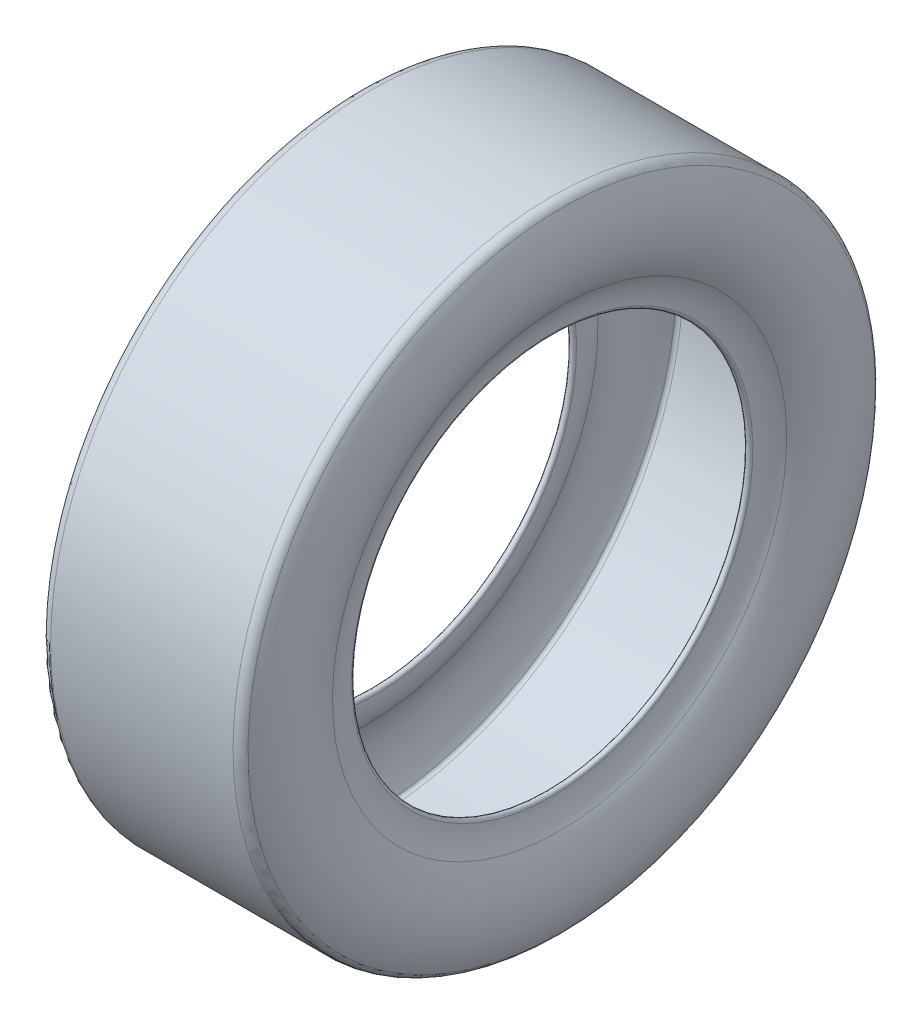
ISO-10303-21;
HEADER;
FILE_DESCRIPTION(('STEP AP214'),'2;1');
FILE_NAME('part.step','',(''),(''),'','','');
FILE_SCHEMA(('AUTOMOTIVE_DESIGN { 1 0 10303 214 1 1 1 1 }'));
ENDSEC;
DATA;
#1=APPLICATION_CONTEXT('core data for automotive mechanical design processes');
#2=APPLICATION_PROTOCOL_DEFINITION('international standard','automotive_design',2000,#1);
#3=PRODUCT_CONTEXT('',#1,'mechanical');
#4=PRODUCT('Part','Part','',(#3));
#5=PRODUCT_RELATED_PRODUCT_CATEGORY('part','',(#4));
#6=PRODUCT_DEFINITION_FORMATION('','',#4);
#7=PRODUCT_DEFINITION_CONTEXT('part definition',#1,'design');
#8=PRODUCT_DEFINITION('design','',#6,#7);
#9=PRODUCT_DEFINITION_SHAPE('','',#8);
#10=(LENGTH_UNIT() NAMED_UNIT(*) SI_UNIT(.MILLI.,.METRE.));
#11=(NAMED_UNIT(*) PLANE_ANGLE_UNIT() SI_UNIT($,.RADIAN.));
#12=(NAMED_UNIT(*) SI_UNIT($,.STERADIAN.) SOLID_ANGLE_UNIT());
#13=UNCERTAINTY_MEASURE_WITH_UNIT(LENGTH_MEASURE(1.E-05),#10,'distance_accuracy_value','');
#14=(GEOMETRIC_REPRESENTATION_CONTEXT(3) GLOBAL_UNCERTAINTY_ASSIGNED_CONTEXT((#13)) GLOBAL_UNIT_ASSIGNED_CONTEXT((#10,
#11,#12)) REPRESENTATION_CONTEXT('',''));
#15=CARTESIAN_POINT('',(0.,0.,0.));
#16=DIRECTION('',(0.,0.,1.));
#17=DIRECTION('',(1.,0.,0.));
#18=AXIS2_PLACEMENT_3D('',#15,#16,#17);
#19=CARTESIAN_POINT('',(-76.2,0.,0.));
#20=DIRECTION('',(-1.,0.,0.));
#21=DIRECTION('',(0.,-1.,0.));
#22=AXIS2_PLACEMENT_3D('',#19,#20,#21);
#23=TOROIDAL_SURFACE('',#22,257.813463857242,8.88653614275804);
#24=CARTESIAN_POINT('',(-84.0361974261438,0.,0.));
#25=DIRECTION('',(-1.,0.,0.));
#26=DIRECTION('',(0.,-1.,0.));
#27=AXIS2_PLACEMENT_3D('',#24,#25,#26);
#28=CIRCLE('',#27,262.004470241756);
#29=CARTESIAN_POINT('',(-84.0361974261437,-262.004470241756,0.));
#30=VERTEX_POINT('',#29);
#31=EDGE_CURVE('E10',#30,#30,#28,.T.);
#32=ORIENTED_EDGE('',*,*,#31,.F.);
#33=EDGE_LOOP('',(#32));
#34=FACE_BOUND('',#33,.T.);
#35=CARTESIAN_POINT('',(-76.2,0.,0.));
#36=DIRECTION('',(-1.,0.,0.));
#37=DIRECTION('',(0.,-1.,0.));
#38=AXIS2_PLACEMENT_3D('',#35,#36,#37);
#39=CIRCLE('',#38,266.7);
#40=CARTESIAN_POINT('',(-76.1999999999999,-266.7,0.));
#41=VERTEX_POINT('',#40);
#42=EDGE_CURVE('E82',#41,#41,#39,.T.);
#43=ORIENTED_EDGE('',*,*,#42,.T.);
#44=EDGE_LOOP('',(#43));
#45=FACE_BOUND('',#44,.T.);
#46=ADVANCED_FACE('F30',(#34,#45),#23,.T.);
#47=CARTESIAN_POINT('',(-19.3240923413791,0.,0.));
#48=DIRECTION('',(-1.,0.,0.));
#49=DIRECTION('',(0.,-1.,0.));
#50=AXIS2_PLACEMENT_3D('',#47,#48,#49);
#51=TOROIDAL_SURFACE('',#50,227.394718749178,73.3859076586209);
#52=CARTESIAN_POINT('',(-82.3001831027872,0.,0.));
#53=DIRECTION('',(-1.,0.,0.));
#54=DIRECTION('',(0.,-1.,0.));
#55=AXIS2_PLACEMENT_3D('',#52,#53,#54);
#56=CIRCLE('',#55,189.718420692037);
#57=CARTESIAN_POINT('',(-82.3001831027871,-189.718420692037,0.));
#58=VERTEX_POINT('',#57);
#59=EDGE_CURVE('E36',#58,#58,#56,.T.);
#60=ORIENTED_EDGE('',*,*,#59,.F.);
#61=EDGE_LOOP('',(#60));
#62=FACE_BOUND('',#61,.T.);
#63=ORIENTED_EDGE('',*,*,#31,.T.);
#64=EDGE_LOOP('',(#63));
#65=FACE_BOUND('',#64,.T.);
#66=ADVANCED_FACE('F167',(#62,#65),#51,.T.);
#67=CARTESIAN_POINT('',(-119.204356205504,0.,0.));
#68=DIRECTION('',(-1.,0.,0.));
#69=DIRECTION('',(0.,-1.,0.));
#70=AXIS2_PLACEMENT_3D('',#67,#68,#69);
#71=TOROIDAL_SURFACE('',#70,167.64,43.0043562055044);
#72=CARTESIAN_POINT('',(-76.2,0.,0.));
#73=DIRECTION('',(-1.,0.,0.));
#74=DIRECTION('',(0.,-1.,0.));
#75=AXIS2_PLACEMENT_3D('',#72,#73,#74);
#76=CIRCLE('',#75,167.64);
#77=CARTESIAN_POINT('',(-76.2,-167.64,0.));
#78=VERTEX_POINT('',#77);
#79=EDGE_CURVE('E40',#78,#78,#76,.T.);
#80=ORIENTED_EDGE('',*,*,#79,.F.);
#81=EDGE_LOOP('',(#80));
#82=FACE_BOUND('',#81,.T.);
#83=ORIENTED_EDGE('',*,*,#59,.T.);
#84=EDGE_LOOP('',(#83));
#85=FACE_BOUND('',#84,.T.);
#86=ADVANCED_FACE('F162',(#82,#85),#71,.F.);
#87=CARTESIAN_POINT('',(-73.66,0.,0.));
#88=DIRECTION('',(-1.,0.,0.));
#89=DIRECTION('',(0.,-1.,0.));
#90=AXIS2_PLACEMENT_3D('',#87,#88,#89);
#91=TOROIDAL_SURFACE('',#90,167.64,2.54);
#92=CARTESIAN_POINT('',(-71.12,0.,0.));
#93=DIRECTION('',(-1.,0.,0.));
#94=DIRECTION('',(0.,-1.,0.));
#95=AXIS2_PLACEMENT_3D('',#92,#93,#94);
#96=CIRCLE('',#95,167.64);
#97=CARTESIAN_POINT('',(-71.1199999999999,-167.64,0.));
#98=VERTEX_POINT('',#97);
#99=EDGE_CURVE('E44',#98,#98,#96,.T.);
#100=ORIENTED_EDGE('',*,*,#99,.F.);
#101=EDGE_LOOP('',(#100));
#102=FACE_BOUND('',#101,.T.);
#103=ORIENTED_EDGE('',*,*,#79,.T.);
#104=EDGE_LOOP('',(#103));
#105=FACE_BOUND('',#104,.T.);
#106=ADVANCED_FACE('F156',(#102,#105),#91,.T.);
#107=CARTESIAN_POINT('',(-119.204356205504,0.,0.));
#108=DIRECTION('',(-1.,0.,0.));
#109=DIRECTION('',(0.,-1.,0.));
#110=AXIS2_PLACEMENT_3D('',#107,#108,#109);
#111=TOROIDAL_SURFACE('',#110,167.64,48.0843562055045);
#112=CARTESIAN_POINT('',(-77.9407828953773,0.,0.));
#113=DIRECTION('',(-1.,0.,0.));
#114=DIRECTION('',(0.,-1.,0.));
#115=AXIS2_PLACEMENT_3D('',#112,#113,#114);
#116=CIRCLE('',#115,192.326490827527);
#117=CARTESIAN_POINT('',(-77.9407828953772,-192.326490827527,0.));
#118=VERTEX_POINT('',#117);
#119=EDGE_CURVE('E49',#118,#118,#116,.T.);
#120=ORIENTED_EDGE('',*,*,#119,.F.);
#121=EDGE_LOOP('',(#120));
#122=FACE_BOUND('',#121,.T.);
#123=ORIENTED_EDGE('',*,*,#99,.T.);
#124=EDGE_LOOP('',(#123));
#125=FACE_BOUND('',#124,.T.);
#126=ADVANCED_FACE('F150',(#122,#125),#111,.T.);
#127=CARTESIAN_POINT('',(-19.3240923413791,0.,0.));
#128=DIRECTION('',(-1.,0.,0.));
#129=DIRECTION('',(0.,-1.,0.));
#130=AXIS2_PLACEMENT_3D('',#127,#128,#129);
#131=TOROIDAL_SURFACE('',#130,227.394718749178,68.3059076586208);
#132=CARTESIAN_POINT('',(-79.5566249262049,0.,0.));
#133=DIRECTION('',(-1.,0.,0.));
#134=DIRECTION('',(0.,-1.,0.));
#135=AXIS2_PLACEMENT_3D('',#132,#133,#134);
#136=CIRCLE('',#135,259.608675964738);
#137=CARTESIAN_POINT('',(-79.5566249262049,-259.608675964738,0.));
#138=VERTEX_POINT('',#137);
#139=EDGE_CURVE('E52',#138,#138,#136,.T.);
#140=ORIENTED_EDGE('',*,*,#139,.F.);
#141=EDGE_LOOP('',(#140));
#142=FACE_BOUND('',#141,.T.);
#143=ORIENTED_EDGE('',*,*,#119,.T.);
#144=EDGE_LOOP('',(#143));
#145=FACE_BOUND('',#144,.T.);
#146=ADVANCED_FACE('F144',(#142,#145),#131,.F.);
#147=CARTESIAN_POINT('',(-76.2,0.,0.));
#148=DIRECTION('',(-1.,0.,0.));
#149=DIRECTION('',(0.,-1.,0.));
#150=AXIS2_PLACEMENT_3D('',#147,#148,#149);
#151=TOROIDAL_SURFACE('',#150,257.813463857242,3.80653614275785);
#152=CARTESIAN_POINT('',(-76.2,0.,0.));
#153=DIRECTION('',(-1.,0.,0.));
#154=DIRECTION('',(0.,-1.,0.));
#155=AXIS2_PLACEMENT_3D('',#152,#153,#154);
#156=CIRCLE('',#155,261.62);
#157=CARTESIAN_POINT('',(-76.1999999999999,-261.62,0.));
#158=VERTEX_POINT('',#157);
#159=EDGE_CURVE('E55',#158,#158,#156,.T.);
#160=ORIENTED_EDGE('',*,*,#159,.F.);
#161=EDGE_LOOP('',(#160));
#162=FACE_BOUND('',#161,.T.);
#163=ORIENTED_EDGE('',*,*,#139,.T.);
#164=EDGE_LOOP('',(#163));
#165=FACE_BOUND('',#164,.T.);
#166=ADVANCED_FACE('F138',(#162,#165),#151,.F.);
#167=CARTESIAN_POINT('',(-23.1787160204675,0.,0.));
#168=DIRECTION('',(-1.,0.,0.));
#169=DIRECTION('',(0.,-1.,0.));
#170=AXIS2_PLACEMENT_3D('',#167,#168,#169);
#171=CYLINDRICAL_SURFACE('',#170,261.62);
#172=CARTESIAN_POINT('',(76.2,0.,0.));
#173=DIRECTION('',(-1.,0.,0.));
#174=DIRECTION('',(0.,-1.,0.));
#175=AXIS2_PLACEMENT_3D('',#172,#173,#174);
#176=CIRCLE('',#175,261.62);
#177=CARTESIAN_POINT('',(76.2000000000001,-261.62,0.));
#178=VERTEX_POINT('',#177);
#179=EDGE_CURVE('E58',#178,#178,#176,.T.);
#180=ORIENTED_EDGE('',*,*,#179,.F.);
#181=EDGE_LOOP('',(#180));
#182=FACE_BOUND('',#181,.T.);
#183=ORIENTED_EDGE('',*,*,#159,.T.);
#184=EDGE_LOOP('',(#183));
#185=FACE_BOUND('',#184,.T.);
#186=ADVANCED_FACE('F132',(#182,#185),#171,.F.);
#187=CARTESIAN_POINT('',(76.2,0.,0.));
#188=DIRECTION('',(-1.,0.,0.));
#189=DIRECTION('',(0.,-1.,0.));
#190=AXIS2_PLACEMENT_3D('',#187,#188,#189);
#191=TOROIDAL_SURFACE('',#190,257.813463857242,3.80653614275785);
#192=CARTESIAN_POINT('',(79.556624926205,0.,0.));
#193=DIRECTION('',(-1.,0.,0.));
#194=DIRECTION('',(0.,-1.,0.));
#195=AXIS2_PLACEMENT_3D('',#192,#193,#194);
#196=CIRCLE('',#195,259.608675964738);
#197=CARTESIAN_POINT('',(79.556624926205,-259.608675964738,0.));
#198=VERTEX_POINT('',#197);
#199=EDGE_CURVE('E61',#198,#198,#196,.T.);
#200=ORIENTED_EDGE('',*,*,#199,.F.);
#201=EDGE_LOOP('',(#200));
#202=FACE_BOUND('',#201,.T.);
#203=ORIENTED_EDGE('',*,*,#179,.T.);
#204=EDGE_LOOP('',(#203));
#205=FACE_BOUND('',#204,.T.);
#206=ADVANCED_FACE('F126',(#202,#205),#191,.F.);
#207=CARTESIAN_POINT('',(19.3240923413792,0.,0.));
#208=DIRECTION('',(-1.,0.,0.));
#209=DIRECTION('',(0.,-1.,0.));
#210=AXIS2_PLACEMENT_3D('',#207,#208,#209);
#211=TOROIDAL_SURFACE('',#210,227.394718749178,68.3059076586208);
#212=CARTESIAN_POINT('',(77.9407828953773,0.,0.));
#213=DIRECTION('',(-1.,0.,0.));
#214=DIRECTION('',(0.,-1.,0.));
#215=AXIS2_PLACEMENT_3D('',#212,#213,#214);
#216=CIRCLE('',#215,192.326490827527);
#217=CARTESIAN_POINT('',(77.9407828953774,-192.326490827527,0.));
#218=VERTEX_POINT('',#217);
#219=EDGE_CURVE('E64',#218,#218,#216,.T.);
#220=ORIENTED_EDGE('',*,*,#219,.F.);
#221=EDGE_LOOP('',(#220));
#222=FACE_BOUND('',#221,.T.);
#223=ORIENTED_EDGE('',*,*,#199,.T.);
#224=EDGE_LOOP('',(#223));
#225=FACE_BOUND('',#224,.T.);
#226=ADVANCED_FACE('F120',(#222,#225),#211,.F.);
#227=CARTESIAN_POINT('',(119.204356205504,0.,0.));
#228=DIRECTION('',(-1.,0.,0.));
#229=DIRECTION('',(0.,-1.,0.));
#230=AXIS2_PLACEMENT_3D('',#227,#228,#229);
#231=TOROIDAL_SURFACE('',#230,167.64,48.0843562055045);
#232=CARTESIAN_POINT('',(71.12,0.,0.));
#233=DIRECTION('',(-1.,0.,0.));
#234=DIRECTION('',(0.,-1.,0.));
#235=AXIS2_PLACEMENT_3D('',#232,#233,#234);
#236=CIRCLE('',#235,167.64);
#237=CARTESIAN_POINT('',(71.12,-167.64,0.));
#238=VERTEX_POINT('',#237);
#239=EDGE_CURVE('E67',#238,#238,#236,.T.);
#240=ORIENTED_EDGE('',*,*,#239,.F.);
#241=EDGE_LOOP('',(#240));
#242=FACE_BOUND('',#241,.T.);
#243=ORIENTED_EDGE('',*,*,#219,.T.);
#244=EDGE_LOOP('',(#243));
#245=FACE_BOUND('',#244,.T.);
#246=ADVANCED_FACE('F114',(#242,#245),#231,.T.);
#247=CARTESIAN_POINT('',(73.66,0.,0.));
#248=DIRECTION('',(-1.,0.,0.));
#249=DIRECTION('',(0.,-1.,0.));
#250=AXIS2_PLACEMENT_3D('',#247,#248,#249);
#251=TOROIDAL_SURFACE('',#250,167.64,2.54);
#252=CARTESIAN_POINT('',(76.2,0.,0.));
#253=DIRECTION('',(-1.,0.,0.));
#254=DIRECTION('',(0.,-1.,0.));
#255=AXIS2_PLACEMENT_3D('',#252,#253,#254);
#256=CIRCLE('',#255,167.64);
#257=CARTESIAN_POINT('',(76.2000000000001,-167.64,0.));
#258=VERTEX_POINT('',#257);
#259=EDGE_CURVE('E70',#258,#258,#256,.T.);
#260=ORIENTED_EDGE('',*,*,#259,.F.);
#261=EDGE_LOOP('',(#260));
#262=FACE_BOUND('',#261,.T.);
#263=ORIENTED_EDGE('',*,*,#239,.T.);
#264=EDGE_LOOP('',(#263));
#265=FACE_BOUND('',#264,.T.);
#266=ADVANCED_FACE('F108',(#262,#265),#251,.T.);
#267=CARTESIAN_POINT('',(119.204356205504,0.,0.));
#268=DIRECTION('',(-1.,0.,0.));
#269=DIRECTION('',(0.,-1.,0.));
#270=AXIS2_PLACEMENT_3D('',#267,#268,#269);
#271=TOROIDAL_SURFACE('',#270,167.64,43.0043562055044);
#272=CARTESIAN_POINT('',(82.3001831027873,0.,0.));
#273=DIRECTION('',(-1.,0.,0.));
#274=DIRECTION('',(0.,-1.,0.));
#275=AXIS2_PLACEMENT_3D('',#272,#273,#274);
#276=CIRCLE('',#275,189.718420692037);
#277=CARTESIAN_POINT('',(82.3001831027873,-189.718420692037,0.));
#278=VERTEX_POINT('',#277);
#279=EDGE_CURVE('E73',#278,#278,#276,.T.);
#280=ORIENTED_EDGE('',*,*,#279,.F.);
#281=EDGE_LOOP('',(#280));
#282=FACE_BOUND('',#281,.T.);
#283=ORIENTED_EDGE('',*,*,#259,.T.);
#284=EDGE_LOOP('',(#283));
#285=FACE_BOUND('',#284,.T.);
#286=ADVANCED_FACE('F102',(#282,#285),#271,.F.);
#287=CARTESIAN_POINT('',(19.3240923413792,0.,0.));
#288=DIRECTION('',(-1.,0.,0.));
#289=DIRECTION('',(0.,-1.,0.));
#290=AXIS2_PLACEMENT_3D('',#287,#288,#289);
#291=TOROIDAL_SURFACE('',#290,227.394718749178,73.3859076586209);
#292=CARTESIAN_POINT('',(84.0361974261439,0.,0.));
#293=DIRECTION('',(-1.,0.,0.));
#294=DIRECTION('',(0.,-1.,0.));
#295=AXIS2_PLACEMENT_3D('',#292,#293,#294);
#296=CIRCLE('',#295,262.004470241756);
#297=CARTESIAN_POINT('',(84.0361974261439,-262.004470241756,0.));
#298=VERTEX_POINT('',#297);
#299=EDGE_CURVE('E76',#298,#298,#296,.T.);
#300=ORIENTED_EDGE('',*,*,#299,.F.);
#301=EDGE_LOOP('',(#300));
#302=FACE_BOUND('',#301,.T.);
#303=ORIENTED_EDGE('',*,*,#279,.T.);
#304=EDGE_LOOP('',(#303));
#305=FACE_BOUND('',#304,.T.);
#306=ADVANCED_FACE('F96',(#302,#305),#291,.T.);
#307=CARTESIAN_POINT('',(76.2,0.,0.));
#308=DIRECTION('',(-1.,0.,0.));
#309=DIRECTION('',(0.,-1.,0.));
#310=AXIS2_PLACEMENT_3D('',#307,#308,#309);
#311=TOROIDAL_SURFACE('',#310,257.813463857242,8.88653614275804);
#312=CARTESIAN_POINT('',(76.2,0.,0.));
#313=DIRECTION('',(-1.,0.,0.));
#314=DIRECTION('',(0.,-1.,0.));
#315=AXIS2_PLACEMENT_3D('',#312,#313,#314);
#316=CIRCLE('',#315,266.7);
#317=CARTESIAN_POINT('',(76.2000000000001,-266.7,0.));
#318=VERTEX_POINT('',#317);
#319=EDGE_CURVE('E79',#318,#318,#316,.T.);
#320=ORIENTED_EDGE('',*,*,#319,.F.);
#321=EDGE_LOOP('',(#320));
#322=FACE_BOUND('',#321,.T.);
#323=ORIENTED_EDGE('',*,*,#299,.T.);
#324=EDGE_LOOP('',(#323));
#325=FACE_BOUND('',#324,.T.);
#326=ADVANCED_FACE('F90',(#322,#325),#311,.T.);
#327=CARTESIAN_POINT('',(-23.1787160204675,0.,0.));
#328=DIRECTION('',(-1.,0.,0.));
#329=DIRECTION('',(0.,-1.,0.));
#330=AXIS2_PLACEMENT_3D('',#327,#328,#329);
#331=CYLINDRICAL_SURFACE('',#330,266.7);
#332=ORIENTED_EDGE('',*,*,#42,.F.);
#333=EDGE_LOOP('',(#332));
#334=FACE_BOUND('',#333,.T.);
#335=ORIENTED_EDGE('',*,*,#319,.T.);
#336=EDGE_LOOP('',(#335));
#337=FACE_BOUND('',#336,.T.);
#338=ADVANCED_FACE('F87',(#334,#337),#331,.T.);
#339=CLOSED_SHELL('',(#46,#66,#86,#106,#126,#146,#166,#186,#206,#226,#246,#266,#286,#306,#326,#338));
#340=MANIFOLD_SOLID_BREP('B2',#339);
#341=ADVANCED_BREP_SHAPE_REPRESENTATION('',(#18,#340),#14);
#342=SHAPE_DEFINITION_REPRESENTATION(#9,#341);
ENDSEC;
END-ISO-10303-21;
